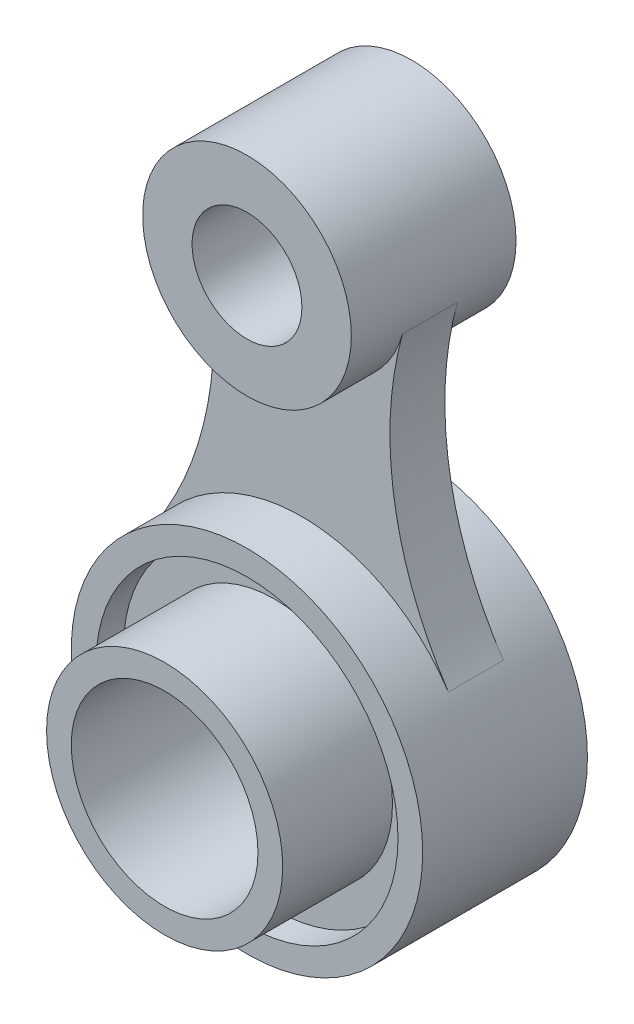
ISO-10303-21;
HEADER;
FILE_DESCRIPTION(('STEP AP214'),'2;1');
FILE_NAME('part.step','',(''),(''),'','','');
FILE_SCHEMA(('AUTOMOTIVE_DESIGN { 1 0 10303 214 1 1 1 1 }'));
ENDSEC;
DATA;
#1=APPLICATION_CONTEXT('core data for automotive mechanical design processes');
#2=APPLICATION_PROTOCOL_DEFINITION('international standard','automotive_design',2000,#1);
#3=PRODUCT_CONTEXT('',#1,'mechanical');
#4=PRODUCT('Part','Part','',(#3));
#5=PRODUCT_RELATED_PRODUCT_CATEGORY('part','',(#4));
#6=PRODUCT_DEFINITION_FORMATION('','',#4);
#7=PRODUCT_DEFINITION_CONTEXT('part definition',#1,'design');
#8=PRODUCT_DEFINITION('design','',#6,#7);
#9=PRODUCT_DEFINITION_SHAPE('','',#8);
#10=(LENGTH_UNIT() NAMED_UNIT(*) SI_UNIT(.MILLI.,.METRE.));
#11=(NAMED_UNIT(*) PLANE_ANGLE_UNIT() SI_UNIT($,.RADIAN.));
#12=(NAMED_UNIT(*) SI_UNIT($,.STERADIAN.) SOLID_ANGLE_UNIT());
#13=UNCERTAINTY_MEASURE_WITH_UNIT(LENGTH_MEASURE(1.E-05),#10,'distance_accuracy_value','');
#14=(GEOMETRIC_REPRESENTATION_CONTEXT(3) GLOBAL_UNCERTAINTY_ASSIGNED_CONTEXT((#13)) GLOBAL_UNIT_ASSIGNED_CONTEXT((#10,
#11,#12)) REPRESENTATION_CONTEXT('',''));
#15=CARTESIAN_POINT('',(0.,0.,0.));
#16=DIRECTION('',(0.,0.,1.));
#17=DIRECTION('',(1.,0.,0.));
#18=AXIS2_PLACEMENT_3D('',#15,#16,#17);
#19=CARTESIAN_POINT('',(-80.034907939529,53.0133333333333,5.));
#20=DIRECTION('',(0.,0.,-1.));
#21=DIRECTION('',(-1.,0.,0.));
#22=AXIS2_PLACEMENT_3D('',#19,#20,#21);
#23=CYLINDRICAL_SURFACE('',#22,64.);
#24=CARTESIAN_POINT('',(-80.034907939529,53.0133333333333,-5.));
#25=DIRECTION('',(0.,0.,1.));
#26=DIRECTION('',(1.,0.,0.));
#27=AXIS2_PLACEMENT_3D('',#24,#25,#26);
#28=CIRCLE('',#27,64.);
#29=CARTESIAN_POINT('',(-18.3212439861572,69.9669076305221,-5.));
#30=VERTEX_POINT('',#29);
#31=CARTESIAN_POINT('',(-26.6783026465097,17.6711111111111,-5.));
#32=VERTEX_POINT('',#31);
#33=EDGE_CURVE('E87',#30,#32,#28,.F.);
#34=ORIENTED_EDGE('',*,*,#33,.T.);
#35=DIRECTION('',(0.,0.,-1.));
#36=VECTOR('',#35,1.);
#37=CARTESIAN_POINT('',(-26.6783026465097,17.6711111111111,5.));
#38=LINE('',#37,#36);
#39=CARTESIAN_POINT('',(-26.6783026465097,17.6711111111111,5.));
#40=VERTEX_POINT('',#39);
#41=EDGE_CURVE('E47',#40,#32,#38,.T.);
#42=ORIENTED_EDGE('',*,*,#41,.F.);
#43=CARTESIAN_POINT('',(-80.034907939529,53.0133333333333,5.));
#44=DIRECTION('',(0.,0.,1.));
#45=DIRECTION('',(1.,0.,0.));
#46=AXIS2_PLACEMENT_3D('',#43,#44,#45);
#47=CIRCLE('',#46,64.);
#48=CARTESIAN_POINT('',(-18.3212439861572,69.9669076305221,5.));
#49=VERTEX_POINT('',#48);
#50=EDGE_CURVE('E100',#49,#40,#47,.F.);
#51=ORIENTED_EDGE('',*,*,#50,.F.);
#52=DIRECTION('',(0.,0.,-1.));
#53=VECTOR('',#52,1.);
#54=CARTESIAN_POINT('',(-18.3212439861572,69.9669076305221,5.));
#55=LINE('',#54,#53);
#56=EDGE_CURVE('E11',#49,#30,#55,.T.);
#57=ORIENTED_EDGE('',*,*,#56,.T.);
#58=EDGE_LOOP('',(#34,#42,#51,#57));
#59=FACE_BOUND('',#58,.T.);
#60=ADVANCED_FACE('F40',(#59),#23,.F.);
#61=CARTESIAN_POINT('',(80.034907939529,53.0133333333333,5.));
#62=DIRECTION('',(0.,0.,-1.));
#63=DIRECTION('',(-1.,0.,0.));
#64=AXIS2_PLACEMENT_3D('',#61,#62,#63);
#65=CYLINDRICAL_SURFACE('',#64,64.);
#66=CARTESIAN_POINT('',(80.034907939529,53.0133333333333,-5.));
#67=DIRECTION('',(0.,0.,1.));
#68=DIRECTION('',(1.,0.,0.));
#69=AXIS2_PLACEMENT_3D('',#66,#67,#68);
#70=CIRCLE('',#69,64.);
#71=CARTESIAN_POINT('',(18.3212439861573,69.9669076305221,-5.));
#72=VERTEX_POINT('',#71);
#73=CARTESIAN_POINT('',(26.6783026465097,17.6711111111111,-5.));
#74=VERTEX_POINT('',#73);
#75=EDGE_CURVE('E86',#72,#74,#70,.T.);
#76=ORIENTED_EDGE('',*,*,#75,.F.);
#77=DIRECTION('',(0.,0.,-1.));
#78=VECTOR('',#77,1.);
#79=CARTESIAN_POINT('',(18.3212439861573,69.9669076305221,5.));
#80=LINE('',#79,#78);
#81=CARTESIAN_POINT('',(18.3212439861572,69.9669076305221,5.));
#82=VERTEX_POINT('',#81);
#83=EDGE_CURVE('E54',#82,#72,#80,.T.);
#84=ORIENTED_EDGE('',*,*,#83,.F.);
#85=CARTESIAN_POINT('',(80.034907939529,53.0133333333333,5.));
#86=DIRECTION('',(0.,0.,1.));
#87=DIRECTION('',(1.,0.,0.));
#88=AXIS2_PLACEMENT_3D('',#85,#86,#87);
#89=CIRCLE('',#88,64.);
#90=CARTESIAN_POINT('',(26.6783026465097,17.6711111111111,5.));
#91=VERTEX_POINT('',#90);
#92=EDGE_CURVE('E94',#82,#91,#89,.T.);
#93=ORIENTED_EDGE('',*,*,#92,.T.);
#94=DIRECTION('',(0.,0.,-1.));
#95=VECTOR('',#94,1.);
#96=CARTESIAN_POINT('',(26.6783026465097,17.6711111111111,5.));
#97=LINE('',#96,#95);
#98=EDGE_CURVE('E81',#91,#74,#97,.T.);
#99=ORIENTED_EDGE('',*,*,#98,.T.);
#100=EDGE_LOOP('',(#76,#84,#93,#99));
#101=FACE_BOUND('',#100,.T.);
#102=ADVANCED_FACE('F92',(#101),#65,.F.);
#103=CARTESIAN_POINT('',(0.,0.,5.));
#104=DIRECTION('',(0.,0.,1.));
#105=DIRECTION('',(1.,0.,0.));
#106=AXIS2_PLACEMENT_3D('',#103,#104,#105);
#107=PLANE('',#106);
#108=CARTESIAN_POINT('',(0.,75.,5.));
#109=DIRECTION('',(0.,0.,1.));
#110=DIRECTION('',(1.,0.,0.));
#111=AXIS2_PLACEMENT_3D('',#108,#109,#110);
#112=CIRCLE('',#111,19.);
#113=EDGE_CURVE('E98',#49,#82,#112,.T.);
#114=ORIENTED_EDGE('',*,*,#113,.F.);
#115=ORIENTED_EDGE('',*,*,#50,.T.);
#116=CARTESIAN_POINT('',(0.,0.,5.));
#117=DIRECTION('',(0.,0.,1.));
#118=DIRECTION('',(1.,0.,0.));
#119=AXIS2_PLACEMENT_3D('',#116,#117,#118);
#120=CIRCLE('',#119,32.);
#121=EDGE_CURVE('E104',#91,#40,#120,.T.);
#122=ORIENTED_EDGE('',*,*,#121,.F.);
#123=ORIENTED_EDGE('',*,*,#92,.F.);
#124=EDGE_LOOP('',(#114,#115,#122,#123));
#125=FACE_BOUND('',#124,.T.);
#126=ADVANCED_FACE('F117',(#125),#107,.T.);
#127=CARTESIAN_POINT('',(0.,0.,-5.));
#128=DIRECTION('',(0.,0.,1.));
#129=DIRECTION('',(1.,0.,0.));
#130=AXIS2_PLACEMENT_3D('',#127,#128,#129);
#131=PLANE('',#130);
#132=CARTESIAN_POINT('',(0.,75.,-5.));
#133=DIRECTION('',(0.,0.,1.));
#134=DIRECTION('',(1.,0.,0.));
#135=AXIS2_PLACEMENT_3D('',#132,#133,#134);
#136=CIRCLE('',#135,19.);
#137=EDGE_CURVE('E97',#30,#72,#136,.T.);
#138=ORIENTED_EDGE('',*,*,#137,.T.);
#139=ORIENTED_EDGE('',*,*,#75,.T.);
#140=CARTESIAN_POINT('',(0.,0.,-5.));
#141=DIRECTION('',(0.,0.,1.));
#142=DIRECTION('',(1.,0.,0.));
#143=AXIS2_PLACEMENT_3D('',#140,#141,#142);
#144=CIRCLE('',#143,32.);
#145=EDGE_CURVE('E77',#74,#32,#144,.T.);
#146=ORIENTED_EDGE('',*,*,#145,.T.);
#147=ORIENTED_EDGE('',*,*,#33,.F.);
#148=EDGE_LOOP('',(#138,#139,#146,#147));
#149=FACE_BOUND('',#148,.T.);
#150=ADVANCED_FACE('F96',(#149),#131,.F.);
#151=CARTESIAN_POINT('',(0.,75.,15.));
#152=DIRECTION('',(0.,0.,-1.));
#153=DIRECTION('',(-1.,0.,0.));
#154=AXIS2_PLACEMENT_3D('',#151,#152,#153);
#155=CYLINDRICAL_SURFACE('',#154,10.);
#156=CARTESIAN_POINT('',(0.,75.,15.));
#157=DIRECTION('',(0.,0.,1.));
#158=DIRECTION('',(1.,0.,0.));
#159=AXIS2_PLACEMENT_3D('',#156,#157,#158);
#160=CIRCLE('',#159,10.);
#161=CARTESIAN_POINT('',(10.,75.,15.));
#162=VERTEX_POINT('',#161);
#163=EDGE_CURVE('E122',#162,#162,#160,.T.);
#164=ORIENTED_EDGE('',*,*,#163,.T.);
#165=EDGE_LOOP('',(#164));
#166=FACE_BOUND('',#165,.T.);
#167=CARTESIAN_POINT('',(0.,75.,-15.));
#168=DIRECTION('',(0.,0.,1.));
#169=DIRECTION('',(1.,0.,0.));
#170=AXIS2_PLACEMENT_3D('',#167,#168,#169);
#171=CIRCLE('',#170,10.);
#172=CARTESIAN_POINT('',(10.,75.,-15.));
#173=VERTEX_POINT('',#172);
#174=EDGE_CURVE('E123',#173,#173,#171,.T.);
#175=ORIENTED_EDGE('',*,*,#174,.F.);
#176=EDGE_LOOP('',(#175));
#177=FACE_BOUND('',#176,.T.);
#178=ADVANCED_FACE('F212',(#166,#177),#155,.F.);
#179=CARTESIAN_POINT('',(0.,75.,15.));
#180=DIRECTION('',(0.,0.,-1.));
#181=DIRECTION('',(-1.,0.,0.));
#182=AXIS2_PLACEMENT_3D('',#179,#180,#181);
#183=CYLINDRICAL_SURFACE('',#182,19.);
#184=ORIENTED_EDGE('',*,*,#113,.T.);
#185=ORIENTED_EDGE('',*,*,#83,.T.);
#186=ORIENTED_EDGE('',*,*,#137,.F.);
#187=ORIENTED_EDGE('',*,*,#56,.F.);
#188=EDGE_LOOP('',(#184,#185,#186,#187));
#189=FACE_BOUND('',#188,.T.);
#190=CARTESIAN_POINT('',(0.,75.,15.));
#191=DIRECTION('',(0.,0.,1.));
#192=DIRECTION('',(1.,0.,0.));
#193=AXIS2_PLACEMENT_3D('',#190,#191,#192);
#194=CIRCLE('',#193,19.);
#195=CARTESIAN_POINT('',(19.,75.,15.));
#196=VERTEX_POINT('',#195);
#197=EDGE_CURVE('E109',#196,#196,#194,.T.);
#198=ORIENTED_EDGE('',*,*,#197,.F.);
#199=EDGE_LOOP('',(#198));
#200=FACE_BOUND('',#199,.T.);
#201=CARTESIAN_POINT('',(0.,75.,-15.));
#202=DIRECTION('',(0.,0.,1.));
#203=DIRECTION('',(1.,0.,0.));
#204=AXIS2_PLACEMENT_3D('',#201,#202,#203);
#205=CIRCLE('',#204,19.);
#206=CARTESIAN_POINT('',(19.,75.,-15.));
#207=VERTEX_POINT('',#206);
#208=EDGE_CURVE('E119',#207,#207,#205,.T.);
#209=ORIENTED_EDGE('',*,*,#208,.T.);
#210=EDGE_LOOP('',(#209));
#211=FACE_BOUND('',#210,.T.);
#212=ADVANCED_FACE('F114',(#189,#200,#211),#183,.T.);
#213=CARTESIAN_POINT('',(0.,0.,15.));
#214=DIRECTION('',(0.,0.,1.));
#215=DIRECTION('',(1.,0.,0.));
#216=AXIS2_PLACEMENT_3D('',#213,#214,#215);
#217=PLANE('',#216);
#218=ORIENTED_EDGE('',*,*,#163,.F.);
#219=EDGE_LOOP('',(#218));
#220=FACE_BOUND('',#219,.T.);
#221=ORIENTED_EDGE('',*,*,#197,.T.);
#222=EDGE_LOOP('',(#221));
#223=FACE_BOUND('',#222,.T.);
#224=ADVANCED_FACE('F219',(#220,#223),#217,.T.);
#225=CARTESIAN_POINT('',(0.,0.,-15.));
#226=DIRECTION('',(0.,0.,1.));
#227=DIRECTION('',(1.,0.,0.));
#228=AXIS2_PLACEMENT_3D('',#225,#226,#227);
#229=PLANE('',#228);
#230=ORIENTED_EDGE('',*,*,#174,.T.);
#231=EDGE_LOOP('',(#230));
#232=FACE_BOUND('',#231,.T.);
#233=ORIENTED_EDGE('',*,*,#208,.F.);
#234=EDGE_LOOP('',(#233));
#235=FACE_BOUND('',#234,.T.);
#236=ADVANCED_FACE('F166',(#232,#235),#229,.F.);
#237=CARTESIAN_POINT('',(0.,0.,15.));
#238=DIRECTION('',(0.,0.,-1.));
#239=DIRECTION('',(-1.,0.,0.));
#240=AXIS2_PLACEMENT_3D('',#237,#238,#239);
#241=CYLINDRICAL_SURFACE('',#240,32.);
#242=ORIENTED_EDGE('',*,*,#121,.T.);
#243=ORIENTED_EDGE('',*,*,#41,.T.);
#244=ORIENTED_EDGE('',*,*,#145,.F.);
#245=ORIENTED_EDGE('',*,*,#98,.F.);
#246=EDGE_LOOP('',(#242,#243,#244,#245));
#247=FACE_BOUND('',#246,.T.);
#248=CARTESIAN_POINT('',(0.,0.,15.));
#249=DIRECTION('',(0.,0.,1.));
#250=DIRECTION('',(1.,0.,0.));
#251=AXIS2_PLACEMENT_3D('',#248,#249,#250);
#252=CIRCLE('',#251,32.);
#253=CARTESIAN_POINT('',(32.,0.,15.));
#254=VERTEX_POINT('',#253);
#255=EDGE_CURVE('E126',#254,#254,#252,.T.);
#256=ORIENTED_EDGE('',*,*,#255,.F.);
#257=EDGE_LOOP('',(#256));
#258=FACE_BOUND('',#257,.T.);
#259=CARTESIAN_POINT('',(0.,0.,-15.));
#260=DIRECTION('',(0.,0.,1.));
#261=DIRECTION('',(1.,0.,0.));
#262=AXIS2_PLACEMENT_3D('',#259,#260,#261);
#263=CIRCLE('',#262,32.);
#264=CARTESIAN_POINT('',(32.,0.,-15.));
#265=VERTEX_POINT('',#264);
#266=EDGE_CURVE('E131',#265,#265,#263,.T.);
#267=ORIENTED_EDGE('',*,*,#266,.T.);
#268=EDGE_LOOP('',(#267));
#269=FACE_BOUND('',#268,.T.);
#270=ADVANCED_FACE('F79',(#247,#258,#269),#241,.T.);
#271=CARTESIAN_POINT('',(0.,0.,15.));
#272=DIRECTION('',(0.,0.,1.));
#273=DIRECTION('',(1.,0.,0.));
#274=AXIS2_PLACEMENT_3D('',#271,#272,#273);
#275=PLANE('',#274);
#276=CARTESIAN_POINT('',(0.,0.,15.));
#277=DIRECTION('',(0.,0.,1.));
#278=DIRECTION('',(1.,0.,0.));
#279=AXIS2_PLACEMENT_3D('',#276,#277,#278);
#280=CIRCLE('',#279,27.5);
#281=CARTESIAN_POINT('',(27.5,0.,15.));
#282=VERTEX_POINT('',#281);
#283=EDGE_CURVE('E145',#282,#282,#280,.T.);
#284=ORIENTED_EDGE('',*,*,#283,.F.);
#285=EDGE_LOOP('',(#284));
#286=FACE_BOUND('',#285,.T.);
#287=ORIENTED_EDGE('',*,*,#255,.T.);
#288=EDGE_LOOP('',(#287));
#289=FACE_BOUND('',#288,.T.);
#290=ADVANCED_FACE('F158',(#286,#289),#275,.T.);
#291=CARTESIAN_POINT('',(0.,0.,-15.));
#292=DIRECTION('',(0.,0.,1.));
#293=DIRECTION('',(1.,0.,0.));
#294=AXIS2_PLACEMENT_3D('',#291,#292,#293);
#295=PLANE('',#294);
#296=ORIENTED_EDGE('',*,*,#266,.F.);
#297=EDGE_LOOP('',(#296));
#298=FACE_BOUND('',#297,.T.);
#299=CARTESIAN_POINT('',(0.,0.,-15.));
#300=DIRECTION('',(0.,0.,1.));
#301=DIRECTION('',(1.,0.,0.));
#302=AXIS2_PLACEMENT_3D('',#299,#300,#301);
#303=CIRCLE('',#302,17.);
#304=CARTESIAN_POINT('',(17.,0.,-15.));
#305=VERTEX_POINT('',#304);
#306=EDGE_CURVE('E134',#305,#305,#303,.T.);
#307=ORIENTED_EDGE('',*,*,#306,.T.);
#308=EDGE_LOOP('',(#307));
#309=FACE_BOUND('',#308,.T.);
#310=ADVANCED_FACE('F161',(#298,#309),#295,.F.);
#311=CARTESIAN_POINT('',(0.,0.,-15.));
#312=DIRECTION('',(0.,0.,1.));
#313=DIRECTION('',(1.,0.,0.));
#314=AXIS2_PLACEMENT_3D('',#311,#312,#313);
#315=CYLINDRICAL_SURFACE('',#314,17.);
#316=ORIENTED_EDGE('',*,*,#306,.F.);
#317=EDGE_LOOP('',(#316));
#318=FACE_BOUND('',#317,.T.);
#319=CARTESIAN_POINT('',(0.,0.,30.));
#320=DIRECTION('',(0.,0.,1.));
#321=DIRECTION('',(1.,0.,0.));
#322=AXIS2_PLACEMENT_3D('',#319,#320,#321);
#323=CIRCLE('',#322,17.);
#324=CARTESIAN_POINT('',(17.,0.,30.));
#325=VERTEX_POINT('',#324);
#326=EDGE_CURVE('E142',#325,#325,#323,.T.);
#327=ORIENTED_EDGE('',*,*,#326,.T.);
#328=EDGE_LOOP('',(#327));
#329=FACE_BOUND('',#328,.T.);
#330=ADVANCED_FACE('F172',(#318,#329),#315,.F.);
#331=CARTESIAN_POINT('',(0.,0.,-15.));
#332=DIRECTION('',(0.,0.,1.));
#333=DIRECTION('',(1.,0.,0.));
#334=AXIS2_PLACEMENT_3D('',#331,#332,#333);
#335=CYLINDRICAL_SURFACE('',#334,21.5);
#336=CARTESIAN_POINT('',(0.,0.,30.));
#337=DIRECTION('',(0.,0.,1.));
#338=DIRECTION('',(1.,0.,0.));
#339=AXIS2_PLACEMENT_3D('',#336,#337,#338);
#340=CIRCLE('',#339,21.5);
#341=CARTESIAN_POINT('',(21.5,0.,30.));
#342=VERTEX_POINT('',#341);
#343=EDGE_CURVE('E139',#342,#342,#340,.T.);
#344=ORIENTED_EDGE('',*,*,#343,.F.);
#345=EDGE_LOOP('',(#344));
#346=FACE_BOUND('',#345,.T.);
#347=CARTESIAN_POINT('',(0.,0.,10.));
#348=DIRECTION('',(0.,0.,1.));
#349=DIRECTION('',(1.,0.,0.));
#350=AXIS2_PLACEMENT_3D('',#347,#348,#349);
#351=CIRCLE('',#350,21.5);
#352=CARTESIAN_POINT('',(21.5,0.,10.));
#353=VERTEX_POINT('',#352);
#354=EDGE_CURVE('E149',#353,#353,#351,.T.);
#355=ORIENTED_EDGE('',*,*,#354,.T.);
#356=EDGE_LOOP('',(#355));
#357=FACE_BOUND('',#356,.T.);
#358=ADVANCED_FACE('F178',(#346,#357),#335,.T.);
#359=CARTESIAN_POINT('',(0.,0.,30.));
#360=DIRECTION('',(0.,0.,1.));
#361=DIRECTION('',(1.,0.,0.));
#362=AXIS2_PLACEMENT_3D('',#359,#360,#361);
#363=PLANE('',#362);
#364=ORIENTED_EDGE('',*,*,#326,.F.);
#365=EDGE_LOOP('',(#364));
#366=FACE_BOUND('',#365,.T.);
#367=ORIENTED_EDGE('',*,*,#343,.T.);
#368=EDGE_LOOP('',(#367));
#369=FACE_BOUND('',#368,.T.);
#370=ADVANCED_FACE('F182',(#366,#369),#363,.T.);
#371=CARTESIAN_POINT('',(0.,0.,15.));
#372=DIRECTION('',(0.,0.,-1.));
#373=DIRECTION('',(-1.,0.,0.));
#374=AXIS2_PLACEMENT_3D('',#371,#372,#373);
#375=CYLINDRICAL_SURFACE('',#374,27.5);
#376=ORIENTED_EDGE('',*,*,#283,.T.);
#377=EDGE_LOOP('',(#376));
#378=FACE_BOUND('',#377,.T.);
#379=CARTESIAN_POINT('',(0.,0.,10.));
#380=DIRECTION('',(0.,0.,1.));
#381=DIRECTION('',(1.,0.,0.));
#382=AXIS2_PLACEMENT_3D('',#379,#380,#381);
#383=CIRCLE('',#382,27.5);
#384=CARTESIAN_POINT('',(27.5,0.,10.));
#385=VERTEX_POINT('',#384);
#386=EDGE_CURVE('E146',#385,#385,#383,.T.);
#387=ORIENTED_EDGE('',*,*,#386,.F.);
#388=EDGE_LOOP('',(#387));
#389=FACE_BOUND('',#388,.T.);
#390=ADVANCED_FACE('F155',(#378,#389),#375,.F.);
#391=CARTESIAN_POINT('',(0.,0.,10.));
#392=DIRECTION('',(0.,0.,1.));
#393=DIRECTION('',(1.,0.,0.));
#394=AXIS2_PLACEMENT_3D('',#391,#392,#393);
#395=PLANE('',#394);
#396=ORIENTED_EDGE('',*,*,#354,.F.);
#397=EDGE_LOOP('',(#396));
#398=FACE_BOUND('',#397,.T.);
#399=ORIENTED_EDGE('',*,*,#386,.T.);
#400=EDGE_LOOP('',(#399));
#401=FACE_BOUND('',#400,.T.);
#402=ADVANCED_FACE('F193',(#398,#401),#395,.T.);
#403=CLOSED_SHELL('',(#60,#102,#126,#150,#178,#212,#224,#236,#270,#290,#310,#330,#358,#370,#390,#402));
#404=MANIFOLD_SOLID_BREP('B2',#403);
#405=ADVANCED_BREP_SHAPE_REPRESENTATION('',(#18,#404),#14);
#406=SHAPE_DEFINITION_REPRESENTATION(#9,#405);
ENDSEC;
END-ISO-10303-21;
